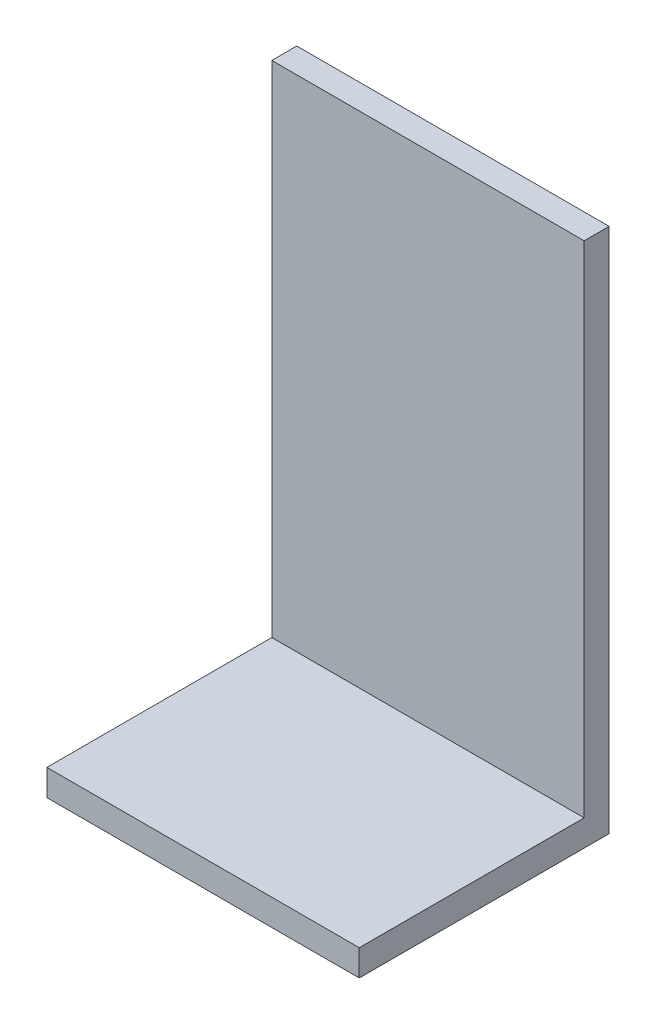
ISO-10303-21;
HEADER;
FILE_DESCRIPTION(('STEP AP214'),'2;1');
FILE_NAME('part.step','',(''),(''),'','','');
FILE_SCHEMA(('AUTOMOTIVE_DESIGN { 1 0 10303 214 1 1 1 1 }'));
ENDSEC;
DATA;
#1=APPLICATION_CONTEXT('core data for automotive mechanical design processes');
#2=APPLICATION_PROTOCOL_DEFINITION('international standard','automotive_design',2000,#1);
#3=PRODUCT_CONTEXT('',#1,'mechanical');
#4=PRODUCT('Part','Part','',(#3));
#5=PRODUCT_RELATED_PRODUCT_CATEGORY('part','',(#4));
#6=PRODUCT_DEFINITION_FORMATION('','',#4);
#7=PRODUCT_DEFINITION_CONTEXT('part definition',#1,'design');
#8=PRODUCT_DEFINITION('design','',#6,#7);
#9=PRODUCT_DEFINITION_SHAPE('','',#8);
#10=(LENGTH_UNIT() NAMED_UNIT(*) SI_UNIT(.MILLI.,.METRE.));
#11=(NAMED_UNIT(*) PLANE_ANGLE_UNIT() SI_UNIT($,.RADIAN.));
#12=(NAMED_UNIT(*) SI_UNIT($,.STERADIAN.) SOLID_ANGLE_UNIT());
#13=UNCERTAINTY_MEASURE_WITH_UNIT(LENGTH_MEASURE(1.E-05),#10,'distance_accuracy_value','');
#14=(GEOMETRIC_REPRESENTATION_CONTEXT(3) GLOBAL_UNCERTAINTY_ASSIGNED_CONTEXT((#13)) GLOBAL_UNIT_ASSIGNED_CONTEXT((#10,
#11,#12)) REPRESENTATION_CONTEXT('',''));
#15=CARTESIAN_POINT('',(0.,0.,0.));
#16=DIRECTION('',(0.,0.,1.));
#17=DIRECTION('',(1.,0.,0.));
#18=AXIS2_PLACEMENT_3D('',#15,#16,#17);
#19=CARTESIAN_POINT('',(-0.27832069959543,-1.5105,0.2));
#20=DIRECTION('',(0.,0.,1.));
#21=DIRECTION('',(0.,-1.,0.));
#22=AXIS2_PLACEMENT_3D('',#19,#20,#21);
#23=PLANE('',#22);
#24=DIRECTION('',(1.,0.,0.));
#25=VECTOR('',#24,1.);
#26=CARTESIAN_POINT('',(-0.27832069959543,-1.521,0.2));
#27=LINE('',#26,#25);
#28=CARTESIAN_POINT('',(-0.40332069959543,-1.521,0.2));
#29=VERTEX_POINT('',#28);
#30=CARTESIAN_POINT('',(-0.15332069959543,-1.521,0.2));
#31=VERTEX_POINT('',#30);
#32=EDGE_CURVE('E92',#29,#31,#27,.T.);
#33=ORIENTED_EDGE('',*,*,#32,.T.);
#34=DIRECTION('',(0.,-1.,0.));
#35=VECTOR('',#34,1.);
#36=CARTESIAN_POINT('',(-0.153320699595431,-1.36847101449275,0.2));
#37=LINE('',#36,#35);
#38=CARTESIAN_POINT('',(-0.15332069959543,-1.5,0.2));
#39=VERTEX_POINT('',#38);
#40=EDGE_CURVE('E90',#39,#31,#37,.T.);
#41=ORIENTED_EDGE('',*,*,#40,.F.);
#42=DIRECTION('',(1.,0.,0.));
#43=VECTOR('',#42,1.);
#44=CARTESIAN_POINT('',(-0.27832069959543,-1.5,0.2));
#45=LINE('',#44,#43);
#46=CARTESIAN_POINT('',(-0.403320699595431,-1.5,0.2));
#47=VERTEX_POINT('',#46);
#48=EDGE_CURVE('E11',#47,#39,#45,.T.);
#49=ORIENTED_EDGE('',*,*,#48,.F.);
#50=DIRECTION('',(0.,-1.,0.));
#51=VECTOR('',#50,1.);
#52=CARTESIAN_POINT('',(-0.40332069959543,-1.36847101449276,0.2));
#53=LINE('',#52,#51);
#54=EDGE_CURVE('E124',#47,#29,#53,.T.);
#55=ORIENTED_EDGE('',*,*,#54,.T.);
#56=EDGE_LOOP('',(#33,#41,#49,#55));
#57=FACE_BOUND('',#56,.T.);
#58=ADVANCED_FACE('F16',(#57),#23,.T.);
#59=CARTESIAN_POINT('',(-0.27832069959543,-1.5,0.11));
#60=DIRECTION('',(0.,1.,0.));
#61=DIRECTION('',(1.,0.,0.));
#62=AXIS2_PLACEMENT_3D('',#59,#60,#61);
#63=PLANE('',#62);
#64=DIRECTION('',(0.,0.,1.));
#65=VECTOR('',#64,1.);
#66=CARTESIAN_POINT('',(-0.40332069959543,-1.5,0.0420289855072462));
#67=LINE('',#66,#65);
#68=CARTESIAN_POINT('',(-0.403320699595432,-1.5,0.02));
#69=VERTEX_POINT('',#68);
#70=EDGE_CURVE('E85',#69,#47,#67,.T.);
#71=ORIENTED_EDGE('',*,*,#70,.T.);
#72=ORIENTED_EDGE('',*,*,#48,.T.);
#73=DIRECTION('',(0.,0.,1.));
#74=VECTOR('',#73,1.);
#75=CARTESIAN_POINT('',(-0.15332069959543,-1.5,0.0420289855072459));
#76=LINE('',#75,#74);
#77=CARTESIAN_POINT('',(-0.15332069959543,-1.5,0.02));
#78=VERTEX_POINT('',#77);
#79=EDGE_CURVE('E82',#78,#39,#76,.T.);
#80=ORIENTED_EDGE('',*,*,#79,.F.);
#81=DIRECTION('',(1.,0.,0.));
#82=VECTOR('',#81,1.);
#83=CARTESIAN_POINT('',(-0.27832069959543,-1.5,0.02));
#84=LINE('',#83,#82);
#85=EDGE_CURVE('E27',#69,#78,#84,.T.);
#86=ORIENTED_EDGE('',*,*,#85,.F.);
#87=EDGE_LOOP('',(#71,#72,#80,#86));
#88=FACE_BOUND('',#87,.T.);
#89=ADVANCED_FACE('F80',(#88),#63,.T.);
#90=CARTESIAN_POINT('',(-0.27832069959543,-1.3,0.02));
#91=DIRECTION('',(0.,0.,1.));
#92=DIRECTION('',(0.,-1.,0.));
#93=AXIS2_PLACEMENT_3D('',#90,#91,#92);
#94=PLANE('',#93);
#95=DIRECTION('',(0.,-1.,0.));
#96=VECTOR('',#95,1.);
#97=CARTESIAN_POINT('',(-0.153320699595431,-1.36847101449275,0.02));
#98=LINE('',#97,#96);
#99=CARTESIAN_POINT('',(-0.153320699595431,-1.1,0.02));
#100=VERTEX_POINT('',#99);
#101=EDGE_CURVE('E101',#100,#78,#98,.T.);
#102=ORIENTED_EDGE('',*,*,#101,.F.);
#103=DIRECTION('',(1.,0.,0.));
#104=VECTOR('',#103,1.);
#105=CARTESIAN_POINT('',(-0.278320699595433,-1.1,0.02));
#106=LINE('',#105,#104);
#107=CARTESIAN_POINT('',(-0.403320699595432,-1.1,0.02));
#108=VERTEX_POINT('',#107);
#109=EDGE_CURVE('E109',#108,#100,#106,.T.);
#110=ORIENTED_EDGE('',*,*,#109,.F.);
#111=DIRECTION('',(0.,-1.,0.));
#112=VECTOR('',#111,1.);
#113=CARTESIAN_POINT('',(-0.40332069959543,-1.36847101449276,0.02));
#114=LINE('',#113,#112);
#115=EDGE_CURVE('E158',#108,#69,#114,.T.);
#116=ORIENTED_EDGE('',*,*,#115,.T.);
#117=ORIENTED_EDGE('',*,*,#85,.T.);
#118=EDGE_LOOP('',(#102,#110,#116,#117));
#119=FACE_BOUND('',#118,.T.);
#120=ADVANCED_FACE('F166',(#119),#94,.T.);
#121=CARTESIAN_POINT('',(-0.40332069959543,-1.36847101449276,0.0420289855072462));
#122=DIRECTION('',(1.,0.,0.));
#123=DIRECTION('',(0.,1.,0.));
#124=AXIS2_PLACEMENT_3D('',#121,#122,#123);
#125=PLANE('',#124);
#126=DIRECTION('',(0.,0.,1.));
#127=VECTOR('',#126,1.);
#128=CARTESIAN_POINT('',(-0.403320699595431,-1.521,0.0999999999999988));
#129=LINE('',#128,#127);
#130=CARTESIAN_POINT('',(-0.403320699595431,-1.521,0.));
#131=VERTEX_POINT('',#130);
#132=EDGE_CURVE('E20',#131,#29,#129,.T.);
#133=ORIENTED_EDGE('',*,*,#132,.T.);
#134=ORIENTED_EDGE('',*,*,#54,.F.);
#135=ORIENTED_EDGE('',*,*,#70,.F.);
#136=ORIENTED_EDGE('',*,*,#115,.F.);
#137=DIRECTION('',(0.,0.,1.));
#138=VECTOR('',#137,1.);
#139=CARTESIAN_POINT('',(-0.403320699595433,-1.1,0.01));
#140=LINE('',#139,#138);
#141=CARTESIAN_POINT('',(-0.403320699595432,-1.1,0.));
#142=VERTEX_POINT('',#141);
#143=EDGE_CURVE('E116',#142,#108,#140,.T.);
#144=ORIENTED_EDGE('',*,*,#143,.F.);
#145=DIRECTION('',(0.,-1.,0.));
#146=VECTOR('',#145,1.);
#147=CARTESIAN_POINT('',(-0.403320699595433,-1.3105,0.));
#148=LINE('',#147,#146);
#149=EDGE_CURVE('E113',#142,#131,#148,.T.);
#150=ORIENTED_EDGE('',*,*,#149,.T.);
#151=EDGE_LOOP('',(#133,#134,#135,#136,#144,#150));
#152=FACE_BOUND('',#151,.T.);
#153=ADVANCED_FACE('F168',(#152),#125,.F.);
#154=CARTESIAN_POINT('',(-0.27832069959543,-1.521,0.0999999999999988));
#155=DIRECTION('',(0.,1.,0.));
#156=DIRECTION('',(1.,0.,0.));
#157=AXIS2_PLACEMENT_3D('',#154,#155,#156);
#158=PLANE('',#157);
#159=DIRECTION('',(1.,0.,0.));
#160=VECTOR('',#159,1.);
#161=CARTESIAN_POINT('',(-0.27832069959543,-1.521,0.));
#162=LINE('',#161,#160);
#163=CARTESIAN_POINT('',(-0.15332069959543,-1.521,0.));
#164=VERTEX_POINT('',#163);
#165=EDGE_CURVE('E138',#131,#164,#162,.T.);
#166=ORIENTED_EDGE('',*,*,#165,.T.);
#167=DIRECTION('',(0.,0.,-1.));
#168=VECTOR('',#167,1.);
#169=CARTESIAN_POINT('',(-0.15332069959543,-1.521,0.0420289855072459));
#170=LINE('',#169,#168);
#171=EDGE_CURVE('E96',#31,#164,#170,.T.);
#172=ORIENTED_EDGE('',*,*,#171,.F.);
#173=ORIENTED_EDGE('',*,*,#32,.F.);
#174=ORIENTED_EDGE('',*,*,#132,.F.);
#175=EDGE_LOOP('',(#166,#172,#173,#174));
#176=FACE_BOUND('',#175,.T.);
#177=ADVANCED_FACE('F266',(#176),#158,.F.);
#178=CARTESIAN_POINT('',(-0.153320699595431,-1.36847101449275,0.0420289855072459));
#179=DIRECTION('',(1.,0.,0.));
#180=DIRECTION('',(0.,1.,0.));
#181=AXIS2_PLACEMENT_3D('',#178,#179,#180);
#182=PLANE('',#181);
#183=ORIENTED_EDGE('',*,*,#101,.T.);
#184=ORIENTED_EDGE('',*,*,#79,.T.);
#185=ORIENTED_EDGE('',*,*,#40,.T.);
#186=ORIENTED_EDGE('',*,*,#171,.T.);
#187=DIRECTION('',(0.,1.,0.));
#188=VECTOR('',#187,1.);
#189=CARTESIAN_POINT('',(-0.15332069959543,-1.3105,0.));
#190=LINE('',#189,#188);
#191=CARTESIAN_POINT('',(-0.153320699595432,-1.1,0.));
#192=VERTEX_POINT('',#191);
#193=EDGE_CURVE('E147',#164,#192,#190,.T.);
#194=ORIENTED_EDGE('',*,*,#193,.T.);
#195=DIRECTION('',(0.,0.,-1.));
#196=VECTOR('',#195,1.);
#197=CARTESIAN_POINT('',(-0.153320699595432,-1.1,0.01));
#198=LINE('',#197,#196);
#199=EDGE_CURVE('E120',#100,#192,#198,.T.);
#200=ORIENTED_EDGE('',*,*,#199,.F.);
#201=EDGE_LOOP('',(#183,#184,#185,#186,#194,#200));
#202=FACE_BOUND('',#201,.T.);
#203=ADVANCED_FACE('F98',(#202),#182,.T.);
#204=CARTESIAN_POINT('',(-0.278320699595433,-1.1,0.01));
#205=DIRECTION('',(0.,1.,0.));
#206=DIRECTION('',(1.,0.,0.));
#207=AXIS2_PLACEMENT_3D('',#204,#205,#206);
#208=PLANE('',#207);
#209=ORIENTED_EDGE('',*,*,#199,.T.);
#210=DIRECTION('',(-1.,0.,0.));
#211=VECTOR('',#210,1.);
#212=CARTESIAN_POINT('',(-0.27832069959543,-1.1,0.));
#213=LINE('',#212,#211);
#214=EDGE_CURVE('E126',#192,#142,#213,.T.);
#215=ORIENTED_EDGE('',*,*,#214,.T.);
#216=ORIENTED_EDGE('',*,*,#143,.T.);
#217=ORIENTED_EDGE('',*,*,#109,.T.);
#218=EDGE_LOOP('',(#209,#215,#216,#217));
#219=FACE_BOUND('',#218,.T.);
#220=ADVANCED_FACE('F18',(#219),#208,.T.);
#221=CARTESIAN_POINT('',(-0.27832069959543,-1.3105,0.));
#222=DIRECTION('',(0.,0.,1.));
#223=DIRECTION('',(0.,-1.,0.));
#224=AXIS2_PLACEMENT_3D('',#221,#222,#223);
#225=PLANE('',#224);
#226=ORIENTED_EDGE('',*,*,#193,.F.);
#227=ORIENTED_EDGE('',*,*,#165,.F.);
#228=ORIENTED_EDGE('',*,*,#149,.F.);
#229=ORIENTED_EDGE('',*,*,#214,.F.);
#230=EDGE_LOOP('',(#226,#227,#228,#229));
#231=FACE_BOUND('',#230,.T.);
#232=ADVANCED_FACE('F259',(#231),#225,.F.);
#233=CLOSED_SHELL('',(#58,#89,#120,#153,#177,#203,#220,#232));
#234=MANIFOLD_SOLID_BREP('B1',#233);
#235=ADVANCED_BREP_SHAPE_REPRESENTATION('',(#18,#234),#14);
#236=SHAPE_DEFINITION_REPRESENTATION(#9,#235);
ENDSEC;
END-ISO-10303-21;
